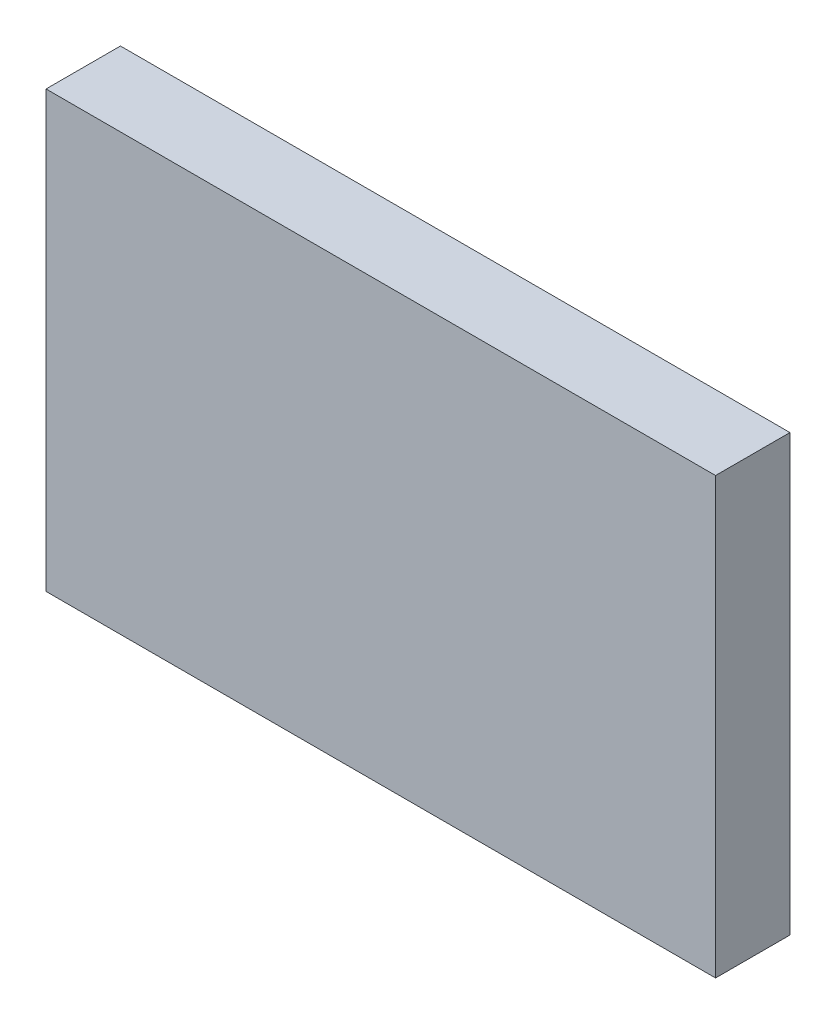
ISO-10303-21;
HEADER;
FILE_DESCRIPTION(('STEP AP214'),'2;1');
FILE_NAME('part.step','',(''),(''),'','','');
FILE_SCHEMA(('AUTOMOTIVE_DESIGN { 1 0 10303 214 1 1 1 1 }'));
ENDSEC;
DATA;
#1=APPLICATION_CONTEXT('core data for automotive mechanical design processes');
#2=APPLICATION_PROTOCOL_DEFINITION('international standard','automotive_design',2000,#1);
#3=PRODUCT_CONTEXT('',#1,'mechanical');
#4=PRODUCT('Part','Part','',(#3));
#5=PRODUCT_RELATED_PRODUCT_CATEGORY('part','',(#4));
#6=PRODUCT_DEFINITION_FORMATION('','',#4);
#7=PRODUCT_DEFINITION_CONTEXT('part definition',#1,'design');
#8=PRODUCT_DEFINITION('design','',#6,#7);
#9=PRODUCT_DEFINITION_SHAPE('','',#8);
#10=(LENGTH_UNIT() NAMED_UNIT(*) SI_UNIT(.MILLI.,.METRE.));
#11=(NAMED_UNIT(*) PLANE_ANGLE_UNIT() SI_UNIT($,.RADIAN.));
#12=(NAMED_UNIT(*) SI_UNIT($,.STERADIAN.) SOLID_ANGLE_UNIT());
#13=UNCERTAINTY_MEASURE_WITH_UNIT(LENGTH_MEASURE(1.E-05),#10,'distance_accuracy_value','');
#14=(GEOMETRIC_REPRESENTATION_CONTEXT(3) GLOBAL_UNCERTAINTY_ASSIGNED_CONTEXT((#13)) GLOBAL_UNIT_ASSIGNED_CONTEXT((#10,
#11,#12)) REPRESENTATION_CONTEXT('',''));
#15=CARTESIAN_POINT('',(0.,0.,0.));
#16=DIRECTION('',(0.,0.,1.));
#17=DIRECTION('',(1.,0.,0.));
#18=AXIS2_PLACEMENT_3D('',#15,#16,#17);
#19=CARTESIAN_POINT('',(22.86,-14.859,5.08));
#20=DIRECTION('',(-1.,0.,0.));
#21=DIRECTION('',(0.,0.,1.));
#22=AXIS2_PLACEMENT_3D('',#19,#20,#21);
#23=PLANE('',#22);
#24=DIRECTION('',(0.,1.,0.));
#25=VECTOR('',#24,1.);
#26=CARTESIAN_POINT('',(22.86,-14.859,0.));
#27=LINE('',#26,#25);
#28=CARTESIAN_POINT('',(22.86,-14.859,0.));
#29=VERTEX_POINT('',#28);
#30=CARTESIAN_POINT('',(22.86,14.859,0.));
#31=VERTEX_POINT('',#30);
#32=EDGE_CURVE('E113',#29,#31,#27,.T.);
#33=ORIENTED_EDGE('',*,*,#32,.T.);
#34=DIRECTION('',(0.,0.,-1.));
#35=VECTOR('',#34,1.);
#36=CARTESIAN_POINT('',(22.86,14.859,5.08));
#37=LINE('',#36,#35);
#38=CARTESIAN_POINT('',(22.86,14.859,5.08));
#39=VERTEX_POINT('',#38);
#40=EDGE_CURVE('E11',#39,#31,#37,.T.);
#41=ORIENTED_EDGE('',*,*,#40,.F.);
#42=DIRECTION('',(0.,1.,0.));
#43=VECTOR('',#42,1.);
#44=CARTESIAN_POINT('',(22.86,-14.859,5.08));
#45=LINE('',#44,#43);
#46=CARTESIAN_POINT('',(22.86,-14.859,5.08));
#47=VERTEX_POINT('',#46);
#48=EDGE_CURVE('E97',#47,#39,#45,.T.);
#49=ORIENTED_EDGE('',*,*,#48,.F.);
#50=DIRECTION('',(0.,0.,-1.));
#51=VECTOR('',#50,1.);
#52=CARTESIAN_POINT('',(22.86,-14.859,5.08));
#53=LINE('',#52,#51);
#54=EDGE_CURVE('E109',#47,#29,#53,.T.);
#55=ORIENTED_EDGE('',*,*,#54,.T.);
#56=EDGE_LOOP('',(#33,#41,#49,#55));
#57=FACE_BOUND('',#56,.T.);
#58=ADVANCED_FACE('F45',(#57),#23,.F.);
#59=CARTESIAN_POINT('',(-22.86,14.859,5.08));
#60=DIRECTION('',(0.,-1.,0.));
#61=DIRECTION('',(0.,0.,-1.));
#62=AXIS2_PLACEMENT_3D('',#59,#60,#61);
#63=PLANE('',#62);
#64=DIRECTION('',(-1.,0.,0.));
#65=VECTOR('',#64,1.);
#66=CARTESIAN_POINT('',(-22.86,14.859,0.));
#67=LINE('',#66,#65);
#68=CARTESIAN_POINT('',(-22.86,14.859,0.));
#69=VERTEX_POINT('',#68);
#70=EDGE_CURVE('E102',#31,#69,#67,.T.);
#71=ORIENTED_EDGE('',*,*,#70,.T.);
#72=DIRECTION('',(0.,0.,-1.));
#73=VECTOR('',#72,1.);
#74=CARTESIAN_POINT('',(-22.86,14.859,5.08));
#75=LINE('',#74,#73);
#76=CARTESIAN_POINT('',(-22.86,14.859,5.08));
#77=VERTEX_POINT('',#76);
#78=EDGE_CURVE('E54',#77,#69,#75,.T.);
#79=ORIENTED_EDGE('',*,*,#78,.F.);
#80=DIRECTION('',(-1.,0.,0.));
#81=VECTOR('',#80,1.);
#82=CARTESIAN_POINT('',(-22.86,14.859,5.08));
#83=LINE('',#82,#81);
#84=EDGE_CURVE('E92',#39,#77,#83,.T.);
#85=ORIENTED_EDGE('',*,*,#84,.F.);
#86=ORIENTED_EDGE('',*,*,#40,.T.);
#87=EDGE_LOOP('',(#71,#79,#85,#86));
#88=FACE_BOUND('',#87,.T.);
#89=ADVANCED_FACE('F101',(#88),#63,.F.);
#90=CARTESIAN_POINT('',(-22.86,-14.859,5.08));
#91=DIRECTION('',(1.,0.,0.));
#92=DIRECTION('',(0.,0.,-1.));
#93=AXIS2_PLACEMENT_3D('',#90,#91,#92);
#94=PLANE('',#93);
#95=DIRECTION('',(0.,-1.,0.));
#96=VECTOR('',#95,1.);
#97=CARTESIAN_POINT('',(-22.86,-14.859,0.));
#98=LINE('',#97,#96);
#99=CARTESIAN_POINT('',(-22.86,-14.859,0.));
#100=VERTEX_POINT('',#99);
#101=EDGE_CURVE('E79',#69,#100,#98,.T.);
#102=ORIENTED_EDGE('',*,*,#101,.T.);
#103=DIRECTION('',(0.,0.,-1.));
#104=VECTOR('',#103,1.);
#105=CARTESIAN_POINT('',(-22.86,-14.859,5.08));
#106=LINE('',#105,#104);
#107=CARTESIAN_POINT('',(-22.86,-14.859,5.08));
#108=VERTEX_POINT('',#107);
#109=EDGE_CURVE('E104',#108,#100,#106,.T.);
#110=ORIENTED_EDGE('',*,*,#109,.F.);
#111=DIRECTION('',(0.,-1.,0.));
#112=VECTOR('',#111,1.);
#113=CARTESIAN_POINT('',(-22.86,-14.859,5.08));
#114=LINE('',#113,#112);
#115=EDGE_CURVE('E95',#77,#108,#114,.T.);
#116=ORIENTED_EDGE('',*,*,#115,.F.);
#117=ORIENTED_EDGE('',*,*,#78,.T.);
#118=EDGE_LOOP('',(#102,#110,#116,#117));
#119=FACE_BOUND('',#118,.T.);
#120=ADVANCED_FACE('F105',(#119),#94,.F.);
#121=CARTESIAN_POINT('',(-22.86,-14.859,5.08));
#122=DIRECTION('',(0.,1.,0.));
#123=DIRECTION('',(0.,0.,1.));
#124=AXIS2_PLACEMENT_3D('',#121,#122,#123);
#125=PLANE('',#124);
#126=DIRECTION('',(1.,0.,0.));
#127=VECTOR('',#126,1.);
#128=CARTESIAN_POINT('',(-22.86,-14.859,0.));
#129=LINE('',#128,#127);
#130=EDGE_CURVE('E85',#100,#29,#129,.T.);
#131=ORIENTED_EDGE('',*,*,#130,.T.);
#132=ORIENTED_EDGE('',*,*,#54,.F.);
#133=DIRECTION('',(1.,0.,0.));
#134=VECTOR('',#133,1.);
#135=CARTESIAN_POINT('',(-22.86,-14.859,5.08));
#136=LINE('',#135,#134);
#137=EDGE_CURVE('E62',#108,#47,#136,.T.);
#138=ORIENTED_EDGE('',*,*,#137,.F.);
#139=ORIENTED_EDGE('',*,*,#109,.T.);
#140=EDGE_LOOP('',(#131,#132,#138,#139));
#141=FACE_BOUND('',#140,.T.);
#142=ADVANCED_FACE('F126',(#141),#125,.F.);
#143=CARTESIAN_POINT('',(0.,0.,5.08));
#144=DIRECTION('',(0.,0.,-1.));
#145=DIRECTION('',(-1.,0.,0.));
#146=AXIS2_PLACEMENT_3D('',#143,#144,#145);
#147=PLANE('',#146);
#148=ORIENTED_EDGE('',*,*,#48,.T.);
#149=ORIENTED_EDGE('',*,*,#84,.T.);
#150=ORIENTED_EDGE('',*,*,#115,.T.);
#151=ORIENTED_EDGE('',*,*,#137,.T.);
#152=EDGE_LOOP('',(#148,#149,#150,#151));
#153=FACE_BOUND('',#152,.T.);
#154=ADVANCED_FACE('F93',(#153),#147,.F.);
#155=CARTESIAN_POINT('',(0.,0.,0.));
#156=DIRECTION('',(0.,0.,-1.));
#157=DIRECTION('',(-1.,0.,0.));
#158=AXIS2_PLACEMENT_3D('',#155,#156,#157);
#159=PLANE('',#158);
#160=ORIENTED_EDGE('',*,*,#32,.F.);
#161=ORIENTED_EDGE('',*,*,#130,.F.);
#162=ORIENTED_EDGE('',*,*,#101,.F.);
#163=ORIENTED_EDGE('',*,*,#70,.F.);
#164=EDGE_LOOP('',(#160,#161,#162,#163));
#165=FACE_BOUND('',#164,.T.);
#166=ADVANCED_FACE('F129',(#165),#159,.T.);
#167=CLOSED_SHELL('',(#58,#89,#120,#142,#154,#166));
#168=MANIFOLD_SOLID_BREP('B2',#167);
#169=ADVANCED_BREP_SHAPE_REPRESENTATION('',(#18,#168),#14);
#170=SHAPE_DEFINITION_REPRESENTATION(#9,#169);
ENDSEC;
END-ISO-10303-21;
